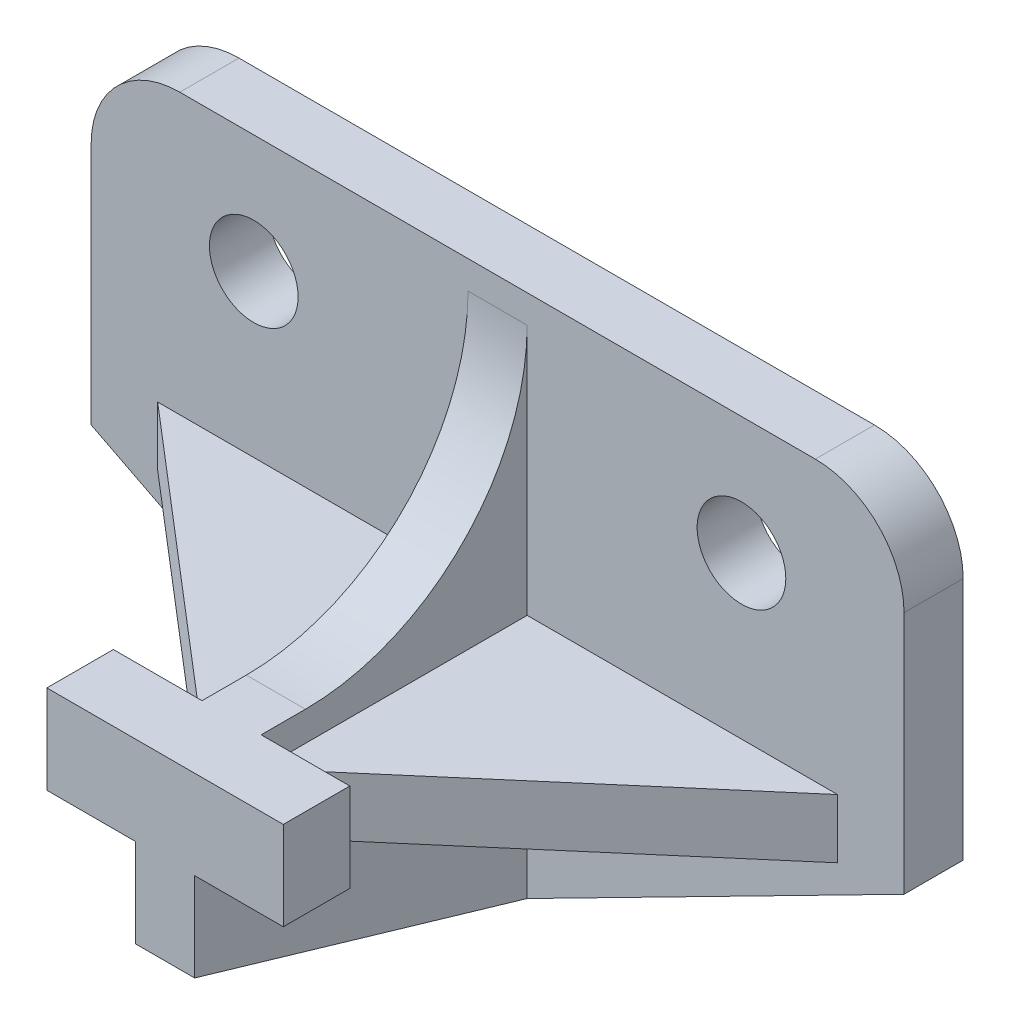
ISO-10303-21;
HEADER;
FILE_DESCRIPTION(('STEP AP214'),'2;1');
FILE_NAME('part.step','',(''),(''),'','','');
FILE_SCHEMA(('AUTOMOTIVE_DESIGN { 1 0 10303 214 1 1 1 1 }'));
ENDSEC;
DATA;
#1=APPLICATION_CONTEXT('core data for automotive mechanical design processes');
#2=APPLICATION_PROTOCOL_DEFINITION('international standard','automotive_design',2000,#1);
#3=PRODUCT_CONTEXT('',#1,'mechanical');
#4=PRODUCT('Part','Part','',(#3));
#5=PRODUCT_RELATED_PRODUCT_CATEGORY('part','',(#4));
#6=PRODUCT_DEFINITION_FORMATION('','',#4);
#7=PRODUCT_DEFINITION_CONTEXT('part definition',#1,'design');
#8=PRODUCT_DEFINITION('design','',#6,#7);
#9=PRODUCT_DEFINITION_SHAPE('','',#8);
#10=(LENGTH_UNIT() NAMED_UNIT(*) SI_UNIT(.MILLI.,.METRE.));
#11=(NAMED_UNIT(*) PLANE_ANGLE_UNIT() SI_UNIT($,.RADIAN.));
#12=(NAMED_UNIT(*) SI_UNIT($,.STERADIAN.) SOLID_ANGLE_UNIT());
#13=UNCERTAINTY_MEASURE_WITH_UNIT(LENGTH_MEASURE(1.E-05),#10,'distance_accuracy_value','');
#14=(GEOMETRIC_REPRESENTATION_CONTEXT(3) GLOBAL_UNCERTAINTY_ASSIGNED_CONTEXT((#13)) GLOBAL_UNIT_ASSIGNED_CONTEXT((#10,
#11,#12)) REPRESENTATION_CONTEXT('',''));
#15=CARTESIAN_POINT('',(0.,0.,0.));
#16=DIRECTION('',(0.,0.,1.));
#17=DIRECTION('',(1.,0.,0.));
#18=AXIS2_PLACEMENT_3D('',#15,#16,#17);
#19=CARTESIAN_POINT('',(0.,-15.3114963605045,0.));
#20=DIRECTION('',(0.,-1.,0.));
#21=DIRECTION('',(0.,0.,-1.));
#22=AXIS2_PLACEMENT_3D('',#19,#20,#21);
#23=PLANE('',#22);
#24=DIRECTION('',(0.,0.,1.));
#25=VECTOR('',#24,1.);
#26=CARTESIAN_POINT('',(-4.,-15.3114963605045,0.));
#27=LINE('',#26,#25);
#28=CARTESIAN_POINT('',(-4.,-15.3114963605045,0.));
#29=VERTEX_POINT('',#28);
#30=CARTESIAN_POINT('',(-4.,-15.3114963605045,36.));
#31=VERTEX_POINT('',#30);
#32=EDGE_CURVE('E255',#29,#31,#27,.T.);
#33=ORIENTED_EDGE('',*,*,#32,.F.);
#34=DIRECTION('',(-1.,0.,0.));
#35=VECTOR('',#34,1.);
#36=CARTESIAN_POINT('',(-46.,-15.3114963605045,0.));
#37=LINE('',#36,#35);
#38=CARTESIAN_POINT('',(-46.,-15.3114963605045,0.));
#39=VERTEX_POINT('',#38);
#40=EDGE_CURVE('E348',#29,#39,#37,.T.);
#41=ORIENTED_EDGE('',*,*,#40,.T.);
#42=DIRECTION('',(0.759256602365297,0.,0.650791373455968));
#43=VECTOR('',#42,1.);
#44=CARTESIAN_POINT('',(-46.,-15.3114963605045,0.));
#45=LINE('',#44,#43);
#46=EDGE_CURVE('E524',#39,#31,#45,.T.);
#47=ORIENTED_EDGE('',*,*,#46,.T.);
#48=EDGE_LOOP('',(#33,#41,#47));
#49=FACE_BOUND('',#48,.T.);
#50=ADVANCED_FACE('F57',(#49),#23,.F.);
#51=CARTESIAN_POINT('',(0.,0.,36.));
#52=DIRECTION('',(0.,0.,1.));
#53=DIRECTION('',(1.,0.,0.));
#54=AXIS2_PLACEMENT_3D('',#51,#52,#53);
#55=PLANE('',#54);
#56=DIRECTION('',(0.,1.,0.));
#57=VECTOR('',#56,1.);
#58=CARTESIAN_POINT('',(-4.,0.,36.));
#59=LINE('',#58,#57);
#60=CARTESIAN_POINT('',(-4.,-11.3114963605045,36.));
#61=VERTEX_POINT('',#60);
#62=EDGE_CURVE('E251',#31,#61,#59,.T.);
#63=ORIENTED_EDGE('',*,*,#62,.F.);
#64=DIRECTION('',(0.,-1.,0.));
#65=VECTOR('',#64,1.);
#66=CARTESIAN_POINT('',(-3.99999999999998,-15.3114963605045,36.));
#67=LINE('',#66,#65);
#68=CARTESIAN_POINT('',(-4.,-23.3114963605045,36.));
#69=VERTEX_POINT('',#68);
#70=EDGE_CURVE('E346',#31,#69,#67,.T.);
#71=ORIENTED_EDGE('',*,*,#70,.T.);
#72=DIRECTION('',(1.,0.,0.));
#73=VECTOR('',#72,1.);
#74=CARTESIAN_POINT('',(-16.,-23.3114963605045,36.));
#75=LINE('',#74,#73);
#76=CARTESIAN_POINT('',(-16.,-23.3114963605045,36.));
#77=VERTEX_POINT('',#76);
#78=EDGE_CURVE('E302',#77,#69,#75,.T.);
#79=ORIENTED_EDGE('',*,*,#78,.F.);
#80=DIRECTION('',(0.,-1.,0.));
#81=VECTOR('',#80,1.);
#82=CARTESIAN_POINT('',(-16.,-11.3114963605045,36.));
#83=LINE('',#82,#81);
#84=CARTESIAN_POINT('',(-16.,-11.3114963605045,36.));
#85=VERTEX_POINT('',#84);
#86=EDGE_CURVE('E446',#85,#77,#83,.T.);
#87=ORIENTED_EDGE('',*,*,#86,.F.);
#88=DIRECTION('',(-1.,0.,0.));
#89=VECTOR('',#88,1.);
#90=CARTESIAN_POINT('',(-16.,-11.3114963605045,36.));
#91=LINE('',#90,#89);
#92=EDGE_CURVE('E451',#61,#85,#91,.T.);
#93=ORIENTED_EDGE('',*,*,#92,.F.);
#94=EDGE_LOOP('',(#63,#71,#79,#87,#93));
#95=FACE_BOUND('',#94,.T.);
#96=ADVANCED_FACE('F485',(#95),#55,.F.);
#97=CARTESIAN_POINT('',(0.,0.,0.));
#98=DIRECTION('',(0.,0.,-1.));
#99=DIRECTION('',(-1.,0.,0.));
#100=AXIS2_PLACEMENT_3D('',#97,#98,#99);
#101=PLANE('',#100);
#102=CARTESIAN_POINT('',(-33.,6.5,0.));
#103=DIRECTION('',(0.,0.,1.));
#104=DIRECTION('',(1.,0.,0.));
#105=AXIS2_PLACEMENT_3D('',#102,#103,#104);
#106=CIRCLE('',#105,6.);
#107=CARTESIAN_POINT('',(-27.,6.5,0.));
#108=VERTEX_POINT('',#107);
#109=EDGE_CURVE('E733',#108,#108,#106,.T.);
#110=ORIENTED_EDGE('',*,*,#109,.F.);
#111=EDGE_LOOP('',(#110));
#112=FACE_BOUND('',#111,.T.);
#113=CARTESIAN_POINT('',(33.,6.50000000000001,0.));
#114=DIRECTION('',(0.,0.,1.));
#115=DIRECTION('',(1.,0.,0.));
#116=AXIS2_PLACEMENT_3D('',#113,#114,#115);
#117=CIRCLE('',#116,6.00000000000001);
#118=CARTESIAN_POINT('',(39.,6.50000000000001,0.));
#119=VERTEX_POINT('',#118);
#120=EDGE_CURVE('E738',#119,#119,#117,.T.);
#121=ORIENTED_EDGE('',*,*,#120,.F.);
#122=EDGE_LOOP('',(#121));
#123=FACE_BOUND('',#122,.T.);
#124=DIRECTION('',(0.,1.,0.));
#125=VECTOR('',#124,1.);
#126=CARTESIAN_POINT('',(55.,22.5,0.));
#127=LINE('',#126,#125);
#128=CARTESIAN_POINT('',(55.,-22.5,0.));
#129=VERTEX_POINT('',#128);
#130=CARTESIAN_POINT('',(55.,10.5,0.));
#131=VERTEX_POINT('',#130);
#132=EDGE_CURVE('E640',#129,#131,#127,.T.);
#133=ORIENTED_EDGE('',*,*,#132,.T.);
#134=CARTESIAN_POINT('',(43.,10.5,0.));
#135=DIRECTION('',(0.,0.,-1.));
#136=DIRECTION('',(-1.,0.,0.));
#137=AXIS2_PLACEMENT_3D('',#134,#135,#136);
#138=CIRCLE('',#137,12.);
#139=CARTESIAN_POINT('',(43.,22.5,0.));
#140=VERTEX_POINT('',#139);
#141=EDGE_CURVE('E1025',#131,#140,#138,.F.);
#142=ORIENTED_EDGE('',*,*,#141,.T.);
#143=DIRECTION('',(-1.,0.,0.));
#144=VECTOR('',#143,1.);
#145=CARTESIAN_POINT('',(-55.,22.5,0.));
#146=LINE('',#145,#144);
#147=CARTESIAN_POINT('',(-43.,22.5,0.));
#148=VERTEX_POINT('',#147);
#149=EDGE_CURVE('E989',#140,#148,#146,.T.);
#150=ORIENTED_EDGE('',*,*,#149,.T.);
#151=CARTESIAN_POINT('',(-43.,10.5,0.));
#152=DIRECTION('',(0.,0.,-1.));
#153=DIRECTION('',(-1.,0.,0.));
#154=AXIS2_PLACEMENT_3D('',#151,#152,#153);
#155=CIRCLE('',#154,12.);
#156=CARTESIAN_POINT('',(-55.,10.5,0.));
#157=VERTEX_POINT('',#156);
#158=EDGE_CURVE('E1022',#148,#157,#155,.F.);
#159=ORIENTED_EDGE('',*,*,#158,.T.);
#160=DIRECTION('',(0.,-1.,0.));
#161=VECTOR('',#160,1.);
#162=CARTESIAN_POINT('',(-55.,22.5,0.));
#163=LINE('',#162,#161);
#164=CARTESIAN_POINT('',(-55.,-22.5,0.));
#165=VERTEX_POINT('',#164);
#166=EDGE_CURVE('E628',#157,#165,#163,.T.);
#167=ORIENTED_EDGE('',*,*,#166,.T.);
#168=DIRECTION('',(0.89090614690198,-0.454187447440225,0.));
#169=VECTOR('',#168,1.);
#170=CARTESIAN_POINT('',(-3.99999999999999,-48.5,0.));
#171=LINE('',#170,#169);
#172=CARTESIAN_POINT('',(-4.,-48.5,0.));
#173=VERTEX_POINT('',#172);
#174=EDGE_CURVE('E623',#165,#173,#171,.T.);
#175=ORIENTED_EDGE('',*,*,#174,.T.);
#176=DIRECTION('',(0.,-1.,0.));
#177=VECTOR('',#176,1.);
#178=CARTESIAN_POINT('',(-4.,-23.3114963605045,0.));
#179=LINE('',#178,#177);
#180=CARTESIAN_POINT('',(-4.,-23.3114963605045,0.));
#181=VERTEX_POINT('',#180);
#182=EDGE_CURVE('E294',#181,#173,#179,.T.);
#183=ORIENTED_EDGE('',*,*,#182,.F.);
#184=DIRECTION('',(1.,0.,0.));
#185=VECTOR('',#184,1.);
#186=CARTESIAN_POINT('',(-46.,-23.3114963605045,0.));
#187=LINE('',#186,#185);
#188=CARTESIAN_POINT('',(-46.,-23.3114963605045,0.));
#189=VERTEX_POINT('',#188);
#190=EDGE_CURVE('E610',#189,#181,#187,.T.);
#191=ORIENTED_EDGE('',*,*,#190,.F.);
#192=DIRECTION('',(0.,-1.,0.));
#193=VECTOR('',#192,1.);
#194=CARTESIAN_POINT('',(-46.,-15.3114963605045,0.));
#195=LINE('',#194,#193);
#196=EDGE_CURVE('E534',#39,#189,#195,.T.);
#197=ORIENTED_EDGE('',*,*,#196,.F.);
#198=ORIENTED_EDGE('',*,*,#40,.F.);
#199=DIRECTION('',(0.,-1.,0.));
#200=VECTOR('',#199,1.);
#201=CARTESIAN_POINT('',(-4.,0.,0.));
#202=LINE('',#201,#200);
#203=CARTESIAN_POINT('',(-4.,18.6885036394955,0.));
#204=VERTEX_POINT('',#203);
#205=EDGE_CURVE('E260',#204,#29,#202,.T.);
#206=ORIENTED_EDGE('',*,*,#205,.F.);
#207=DIRECTION('',(1.,0.,0.));
#208=VECTOR('',#207,1.);
#209=CARTESIAN_POINT('',(0.,18.6885036394955,0.));
#210=LINE('',#209,#208);
#211=CARTESIAN_POINT('',(4.,18.6885036394955,0.));
#212=VERTEX_POINT('',#211);
#213=EDGE_CURVE('E235',#204,#212,#210,.T.);
#214=ORIENTED_EDGE('',*,*,#213,.T.);
#215=DIRECTION('',(0.,-1.,0.));
#216=VECTOR('',#215,1.);
#217=CARTESIAN_POINT('',(4.,0.,0.));
#218=LINE('',#217,#216);
#219=CARTESIAN_POINT('',(4.,-15.3114963605045,0.));
#220=VERTEX_POINT('',#219);
#221=EDGE_CURVE('E239',#212,#220,#218,.T.);
#222=ORIENTED_EDGE('',*,*,#221,.T.);
#223=CARTESIAN_POINT('',(46.,-15.3114963605045,0.));
#224=VERTEX_POINT('',#223);
#225=EDGE_CURVE('E529',#224,#220,#37,.T.);
#226=ORIENTED_EDGE('',*,*,#225,.F.);
#227=DIRECTION('',(0.,1.,0.));
#228=VECTOR('',#227,1.);
#229=CARTESIAN_POINT('',(46.,-15.3114963605045,0.));
#230=LINE('',#229,#228);
#231=CARTESIAN_POINT('',(46.,-23.3114963605045,0.));
#232=VERTEX_POINT('',#231);
#233=EDGE_CURVE('E322',#232,#224,#230,.T.);
#234=ORIENTED_EDGE('',*,*,#233,.F.);
#235=CARTESIAN_POINT('',(4.,-23.3114963605045,0.));
#236=VERTEX_POINT('',#235);
#237=EDGE_CURVE('E327',#236,#232,#187,.T.);
#238=ORIENTED_EDGE('',*,*,#237,.F.);
#239=DIRECTION('',(0.,1.,0.));
#240=VECTOR('',#239,1.);
#241=CARTESIAN_POINT('',(4.,-23.3114963605045,0.));
#242=LINE('',#241,#240);
#243=CARTESIAN_POINT('',(4.00000000000001,-48.5,0.));
#244=VERTEX_POINT('',#243);
#245=EDGE_CURVE('E278',#244,#236,#242,.T.);
#246=ORIENTED_EDGE('',*,*,#245,.F.);
#247=DIRECTION('',(0.89090614690198,0.454187447440225,0.));
#248=VECTOR('',#247,1.);
#249=CARTESIAN_POINT('',(4.00000000000001,-48.5,0.));
#250=LINE('',#249,#248);
#251=EDGE_CURVE('E354',#244,#129,#250,.T.);
#252=ORIENTED_EDGE('',*,*,#251,.T.);
#253=EDGE_LOOP('',(#133,#142,#150,#159,#167,#175,#183,#191,#197,#198,#206,#214,#222,#226,#234,
#238,#246,#252));
#254=FACE_BOUND('',#253,.T.);
#255=ADVANCED_FACE('F597',(#112,#123,#254),#101,.F.);
#256=CARTESIAN_POINT('',(0.,-23.3114963605045,0.));
#257=DIRECTION('',(0.,1.,0.));
#258=DIRECTION('',(0.,0.,1.));
#259=AXIS2_PLACEMENT_3D('',#256,#257,#258);
#260=PLANE('',#259);
#261=DIRECTION('',(0.,0.,1.));
#262=VECTOR('',#261,1.);
#263=CARTESIAN_POINT('',(4.,-23.3114963605045,0.));
#264=LINE('',#263,#262);
#265=CARTESIAN_POINT('',(4.,-23.3114963605045,36.));
#266=VERTEX_POINT('',#265);
#267=EDGE_CURVE('E279',#236,#266,#264,.T.);
#268=ORIENTED_EDGE('',*,*,#267,.F.);
#269=ORIENTED_EDGE('',*,*,#237,.T.);
#270=DIRECTION('',(-0.759256602365296,0.,0.650791373455969));
#271=VECTOR('',#270,1.);
#272=CARTESIAN_POINT('',(46.,-23.3114963605045,0.));
#273=LINE('',#272,#271);
#274=EDGE_CURVE('E347',#232,#266,#273,.T.);
#275=ORIENTED_EDGE('',*,*,#274,.T.);
#276=EDGE_LOOP('',(#268,#269,#275));
#277=FACE_BOUND('',#276,.T.);
#278=ADVANCED_FACE('F552',(#277),#260,.F.);
#279=CARTESIAN_POINT('',(4.,-23.3114963605045,45.));
#280=VERTEX_POINT('',#279);
#281=EDGE_CURVE('E283',#266,#280,#264,.T.);
#282=ORIENTED_EDGE('',*,*,#281,.F.);
#283=CARTESIAN_POINT('',(16.,-23.3114963605045,36.));
#284=VERTEX_POINT('',#283);
#285=EDGE_CURVE('E443',#266,#284,#75,.T.);
#286=ORIENTED_EDGE('',*,*,#285,.T.);
#287=DIRECTION('',(0.,0.,-1.));
#288=VECTOR('',#287,1.);
#289=CARTESIAN_POINT('',(16.,-23.3114963605045,45.));
#290=LINE('',#289,#288);
#291=CARTESIAN_POINT('',(16.,-23.3114963605045,45.));
#292=VERTEX_POINT('',#291);
#293=EDGE_CURVE('E321',#292,#284,#290,.T.);
#294=ORIENTED_EDGE('',*,*,#293,.F.);
#295=DIRECTION('',(1.,0.,0.));
#296=VECTOR('',#295,1.);
#297=CARTESIAN_POINT('',(-16.,-23.3114963605045,45.));
#298=LINE('',#297,#296);
#299=EDGE_CURVE('E308',#280,#292,#298,.T.);
#300=ORIENTED_EDGE('',*,*,#299,.F.);
#301=EDGE_LOOP('',(#282,#286,#294,#300));
#302=FACE_BOUND('',#301,.T.);
#303=ADVANCED_FACE('F436',(#302),#260,.F.);
#304=DIRECTION('',(0.,0.,1.));
#305=VECTOR('',#304,1.);
#306=CARTESIAN_POINT('',(-4.,-23.3114963605045,0.));
#307=LINE('',#306,#305);
#308=CARTESIAN_POINT('',(-4.,-23.3114963605045,45.));
#309=VERTEX_POINT('',#308);
#310=EDGE_CURVE('E295',#69,#309,#307,.T.);
#311=ORIENTED_EDGE('',*,*,#310,.T.);
#312=CARTESIAN_POINT('',(-16.,-23.3114963605045,45.));
#313=VERTEX_POINT('',#312);
#314=EDGE_CURVE('E317',#313,#309,#298,.T.);
#315=ORIENTED_EDGE('',*,*,#314,.F.);
#316=DIRECTION('',(0.,0.,-1.));
#317=VECTOR('',#316,1.);
#318=CARTESIAN_POINT('',(-16.,-23.3114963605045,45.));
#319=LINE('',#318,#317);
#320=EDGE_CURVE('E467',#313,#77,#319,.T.);
#321=ORIENTED_EDGE('',*,*,#320,.T.);
#322=ORIENTED_EDGE('',*,*,#78,.T.);
#323=EDGE_LOOP('',(#311,#315,#321,#322));
#324=FACE_BOUND('',#323,.T.);
#325=ADVANCED_FACE('F479',(#324),#260,.F.);
#326=EDGE_CURVE('E286',#181,#69,#307,.T.);
#327=ORIENTED_EDGE('',*,*,#326,.T.);
#328=DIRECTION('',(0.759256602365297,0.,0.650791373455968));
#329=VECTOR('',#328,1.);
#330=CARTESIAN_POINT('',(-46.,-23.3114963605045,0.));
#331=LINE('',#330,#329);
#332=EDGE_CURVE('E523',#189,#69,#331,.T.);
#333=ORIENTED_EDGE('',*,*,#332,.F.);
#334=ORIENTED_EDGE('',*,*,#190,.T.);
#335=EDGE_LOOP('',(#327,#333,#334));
#336=FACE_BOUND('',#335,.T.);
#337=ADVANCED_FACE('F679',(#336),#260,.F.);
#338=CARTESIAN_POINT('',(4.00000000000001,-48.5,-8.));
#339=DIRECTION('',(0.454187447440225,-0.89090614690198,0.));
#340=DIRECTION('',(0.89090614690198,0.454187447440225,0.));
#341=AXIS2_PLACEMENT_3D('',#338,#339,#340);
#342=PLANE('',#341);
#343=ORIENTED_EDGE('',*,*,#251,.F.);
#344=DIRECTION('',(0.,0.,1.));
#345=VECTOR('',#344,1.);
#346=CARTESIAN_POINT('',(4.00000000000001,-48.5,-8.));
#347=LINE('',#346,#345);
#348=CARTESIAN_POINT('',(4.00000000000001,-48.5,-8.));
#349=VERTEX_POINT('',#348);
#350=EDGE_CURVE('E619',#349,#244,#347,.T.);
#351=ORIENTED_EDGE('',*,*,#350,.F.);
#352=DIRECTION('',(0.89090614690198,0.454187447440225,0.));
#353=VECTOR('',#352,1.);
#354=CARTESIAN_POINT('',(4.00000000000001,-48.5,-8.));
#355=LINE('',#354,#353);
#356=CARTESIAN_POINT('',(55.,-22.5,-8.));
#357=VERTEX_POINT('',#356);
#358=EDGE_CURVE('E985',#349,#357,#355,.T.);
#359=ORIENTED_EDGE('',*,*,#358,.T.);
#360=DIRECTION('',(0.,0.,1.));
#361=VECTOR('',#360,1.);
#362=CARTESIAN_POINT('',(55.,-22.5,-8.));
#363=LINE('',#362,#361);
#364=EDGE_CURVE('E983',#357,#129,#363,.T.);
#365=ORIENTED_EDGE('',*,*,#364,.T.);
#366=EDGE_LOOP('',(#343,#351,#359,#365));
#367=FACE_BOUND('',#366,.T.);
#368=ADVANCED_FACE('F661',(#367),#342,.T.);
#369=CARTESIAN_POINT('',(-3.99999999999999,-48.5,-8.));
#370=DIRECTION('',(0.,-1.,0.));
#371=DIRECTION('',(0.,0.,-1.));
#372=AXIS2_PLACEMENT_3D('',#369,#370,#371);
#373=PLANE('',#372);
#374=CARTESIAN_POINT('',(-4.,-48.5,0.));
#375=DIRECTION('',(1.,0.,0.));
#376=VECTOR('',#375,1.);
#377=LINE('',#374,#376);
#378=EDGE_CURVE('E627',#173,#244,#377,.T.);
#379=ORIENTED_EDGE('',*,*,#378,.F.);
#380=DIRECTION('',(0.,0.,1.));
#381=VECTOR('',#380,1.);
#382=CARTESIAN_POINT('',(-3.99999999999999,-48.5,-8.));
#383=LINE('',#382,#381);
#384=CARTESIAN_POINT('',(-3.99999999999999,-48.5,-8.));
#385=VERTEX_POINT('',#384);
#386=EDGE_CURVE('E615',#385,#173,#383,.T.);
#387=ORIENTED_EDGE('',*,*,#386,.F.);
#388=DIRECTION('',(1.,0.,0.));
#389=VECTOR('',#388,1.);
#390=CARTESIAN_POINT('',(-3.99999999999999,-48.5,-8.));
#391=LINE('',#390,#389);
#392=EDGE_CURVE('E980',#385,#349,#391,.T.);
#393=ORIENTED_EDGE('',*,*,#392,.T.);
#394=ORIENTED_EDGE('',*,*,#350,.T.);
#395=EDGE_LOOP('',(#379,#387,#393,#394));
#396=FACE_BOUND('',#395,.T.);
#397=ADVANCED_FACE('F651',(#396),#373,.T.);
#398=CARTESIAN_POINT('',(-3.99999999999999,-48.5,-8.));
#399=DIRECTION('',(-0.454187447440225,-0.89090614690198,0.));
#400=DIRECTION('',(0.89090614690198,-0.454187447440225,0.));
#401=AXIS2_PLACEMENT_3D('',#398,#399,#400);
#402=PLANE('',#401);
#403=ORIENTED_EDGE('',*,*,#174,.F.);
#404=DIRECTION('',(0.,0.,1.));
#405=VECTOR('',#404,1.);
#406=CARTESIAN_POINT('',(-55.,-22.5,-8.));
#407=LINE('',#406,#405);
#408=CARTESIAN_POINT('',(-55.,-22.5,-8.));
#409=VERTEX_POINT('',#408);
#410=EDGE_CURVE('E620',#409,#165,#407,.T.);
#411=ORIENTED_EDGE('',*,*,#410,.F.);
#412=DIRECTION('',(0.89090614690198,-0.454187447440225,0.));
#413=VECTOR('',#412,1.);
#414=CARTESIAN_POINT('',(-3.99999999999999,-48.5,-8.));
#415=LINE('',#414,#413);
#416=EDGE_CURVE('E1012',#409,#385,#415,.T.);
#417=ORIENTED_EDGE('',*,*,#416,.T.);
#418=ORIENTED_EDGE('',*,*,#386,.T.);
#419=EDGE_LOOP('',(#403,#411,#417,#418));
#420=FACE_BOUND('',#419,.T.);
#421=ADVANCED_FACE('F660',(#420),#402,.T.);
#422=CARTESIAN_POINT('',(-55.,22.5,-8.));
#423=DIRECTION('',(-1.,0.,0.));
#424=DIRECTION('',(0.,0.,1.));
#425=AXIS2_PLACEMENT_3D('',#422,#423,#424);
#426=PLANE('',#425);
#427=ORIENTED_EDGE('',*,*,#166,.F.);
#428=DIRECTION('',(0.,0.,1.));
#429=VECTOR('',#428,1.);
#430=CARTESIAN_POINT('',(-55.,10.5,-8.));
#431=LINE('',#430,#429);
#432=CARTESIAN_POINT('',(-55.,10.5,-8.));
#433=VERTEX_POINT('',#432);
#434=EDGE_CURVE('E12',#157,#433,#431,.F.);
#435=ORIENTED_EDGE('',*,*,#434,.T.);
#436=DIRECTION('',(0.,-1.,0.));
#437=VECTOR('',#436,1.);
#438=CARTESIAN_POINT('',(-55.,22.5,-8.));
#439=LINE('',#438,#437);
#440=EDGE_CURVE('E720',#433,#409,#439,.T.);
#441=ORIENTED_EDGE('',*,*,#440,.T.);
#442=ORIENTED_EDGE('',*,*,#410,.T.);
#443=EDGE_LOOP('',(#427,#435,#441,#442));
#444=FACE_BOUND('',#443,.T.);
#445=ADVANCED_FACE('F665',(#444),#426,.T.);
#446=CARTESIAN_POINT('',(-55.,22.5,-8.));
#447=DIRECTION('',(0.,1.,0.));
#448=DIRECTION('',(0.,0.,1.));
#449=AXIS2_PLACEMENT_3D('',#446,#447,#448);
#450=PLANE('',#449);
#451=ORIENTED_EDGE('',*,*,#149,.F.);
#452=DIRECTION('',(0.,0.,1.));
#453=VECTOR('',#452,1.);
#454=CARTESIAN_POINT('',(43.,22.5,-8.));
#455=LINE('',#454,#453);
#456=CARTESIAN_POINT('',(43.,22.5,-8.));
#457=VERTEX_POINT('',#456);
#458=EDGE_CURVE('E725',#140,#457,#455,.F.);
#459=ORIENTED_EDGE('',*,*,#458,.T.);
#460=DIRECTION('',(-1.,0.,0.));
#461=VECTOR('',#460,1.);
#462=CARTESIAN_POINT('',(-55.,22.5,-8.));
#463=LINE('',#462,#461);
#464=CARTESIAN_POINT('',(-43.,22.5,-8.));
#465=VERTEX_POINT('',#464);
#466=EDGE_CURVE('E714',#457,#465,#463,.T.);
#467=ORIENTED_EDGE('',*,*,#466,.T.);
#468=DIRECTION('',(0.,0.,1.));
#469=VECTOR('',#468,1.);
#470=CARTESIAN_POINT('',(-43.,22.5,-8.));
#471=LINE('',#470,#469);
#472=EDGE_CURVE('E1021',#465,#148,#471,.T.);
#473=ORIENTED_EDGE('',*,*,#472,.T.);
#474=EDGE_LOOP('',(#451,#459,#467,#473));
#475=FACE_BOUND('',#474,.T.);
#476=ADVANCED_FACE('F669',(#475),#450,.T.);
#477=CARTESIAN_POINT('',(55.,22.5,-8.));
#478=DIRECTION('',(1.,0.,0.));
#479=DIRECTION('',(0.,0.,-1.));
#480=AXIS2_PLACEMENT_3D('',#477,#478,#479);
#481=PLANE('',#480);
#482=DIRECTION('',(0.,1.,0.));
#483=VECTOR('',#482,1.);
#484=CARTESIAN_POINT('',(55.,22.5,-8.));
#485=LINE('',#484,#483);
#486=CARTESIAN_POINT('',(55.,10.5,-8.));
#487=VERTEX_POINT('',#486);
#488=EDGE_CURVE('E721',#357,#487,#485,.T.);
#489=ORIENTED_EDGE('',*,*,#488,.T.);
#490=DIRECTION('',(0.,0.,1.));
#491=VECTOR('',#490,1.);
#492=CARTESIAN_POINT('',(55.,10.5,-8.));
#493=LINE('',#492,#491);
#494=EDGE_CURVE('E634',#487,#131,#493,.T.);
#495=ORIENTED_EDGE('',*,*,#494,.T.);
#496=ORIENTED_EDGE('',*,*,#132,.F.);
#497=ORIENTED_EDGE('',*,*,#364,.F.);
#498=EDGE_LOOP('',(#489,#495,#496,#497));
#499=FACE_BOUND('',#498,.T.);
#500=ADVANCED_FACE('F672',(#499),#481,.T.);
#501=CARTESIAN_POINT('',(0.,0.,-8.));
#502=DIRECTION('',(0.,0.,-1.));
#503=DIRECTION('',(-1.,0.,0.));
#504=AXIS2_PLACEMENT_3D('',#501,#502,#503);
#505=PLANE('',#504);
#506=CARTESIAN_POINT('',(-33.,6.5,-8.));
#507=DIRECTION('',(0.,0.,-1.));
#508=DIRECTION('',(-1.,0.,0.));
#509=AXIS2_PLACEMENT_3D('',#506,#507,#508);
#510=CIRCLE('',#509,6.);
#511=CARTESIAN_POINT('',(-39.,6.5,-8.));
#512=VERTEX_POINT('',#511);
#513=EDGE_CURVE('E61',#512,#512,#510,.T.);
#514=ORIENTED_EDGE('',*,*,#513,.F.);
#515=EDGE_LOOP('',(#514));
#516=FACE_BOUND('',#515,.T.);
#517=CARTESIAN_POINT('',(33.,6.50000000000001,-8.));
#518=DIRECTION('',(0.,0.,-1.));
#519=DIRECTION('',(-1.,0.,0.));
#520=AXIS2_PLACEMENT_3D('',#517,#518,#519);
#521=CIRCLE('',#520,6.00000000000001);
#522=CARTESIAN_POINT('',(27.,6.50000000000001,-8.));
#523=VERTEX_POINT('',#522);
#524=EDGE_CURVE('E713',#523,#523,#521,.T.);
#525=ORIENTED_EDGE('',*,*,#524,.F.);
#526=EDGE_LOOP('',(#525));
#527=FACE_BOUND('',#526,.T.);
#528=ORIENTED_EDGE('',*,*,#466,.F.);
#529=CARTESIAN_POINT('',(43.,10.5,-8.));
#530=DIRECTION('',(0.,0.,-1.));
#531=DIRECTION('',(-1.,0.,0.));
#532=AXIS2_PLACEMENT_3D('',#529,#530,#531);
#533=CIRCLE('',#532,12.);
#534=EDGE_CURVE('E67',#457,#487,#533,.T.);
#535=ORIENTED_EDGE('',*,*,#534,.T.);
#536=ORIENTED_EDGE('',*,*,#488,.F.);
#537=ORIENTED_EDGE('',*,*,#358,.F.);
#538=ORIENTED_EDGE('',*,*,#392,.F.);
#539=ORIENTED_EDGE('',*,*,#416,.F.);
#540=ORIENTED_EDGE('',*,*,#440,.F.);
#541=CARTESIAN_POINT('',(-43.,10.5,-8.));
#542=DIRECTION('',(0.,0.,-1.));
#543=DIRECTION('',(-1.,0.,0.));
#544=AXIS2_PLACEMENT_3D('',#541,#542,#543);
#545=CIRCLE('',#544,12.);
#546=EDGE_CURVE('E80',#433,#465,#545,.T.);
#547=ORIENTED_EDGE('',*,*,#546,.T.);
#548=EDGE_LOOP('',(#528,#535,#536,#537,#538,#539,#540,#547));
#549=FACE_BOUND('',#548,.T.);
#550=ADVANCED_FACE('F676',(#516,#527,#549),#505,.T.);
#551=ORIENTED_EDGE('',*,*,#225,.T.);
#552=DIRECTION('',(0.,0.,1.));
#553=VECTOR('',#552,1.);
#554=CARTESIAN_POINT('',(4.,-15.3114963605045,0.));
#555=LINE('',#554,#553);
#556=CARTESIAN_POINT('',(4.,-15.3114963605045,36.));
#557=VERTEX_POINT('',#556);
#558=EDGE_CURVE('E268',#220,#557,#555,.T.);
#559=ORIENTED_EDGE('',*,*,#558,.T.);
#560=DIRECTION('',(-0.759256602365296,0.,0.650791373455969));
#561=VECTOR('',#560,1.);
#562=CARTESIAN_POINT('',(46.,-15.3114963605045,0.));
#563=LINE('',#562,#561);
#564=EDGE_CURVE('E514',#224,#557,#563,.T.);
#565=ORIENTED_EDGE('',*,*,#564,.F.);
#566=EDGE_LOOP('',(#551,#559,#565));
#567=FACE_BOUND('',#566,.T.);
#568=ADVANCED_FACE('F694',(#567),#23,.F.);
#569=CARTESIAN_POINT('',(19.4823529411765,0.,22.7294117647059));
#570=DIRECTION('',(-0.650791373455969,0.,-0.759256602365296));
#571=DIRECTION('',(-0.759256602365296,0.,0.650791373455969));
#572=AXIS2_PLACEMENT_3D('',#569,#570,#571);
#573=PLANE('',#572);
#574=ORIENTED_EDGE('',*,*,#564,.T.);
#575=DIRECTION('',(0.,1.,0.));
#576=VECTOR('',#575,1.);
#577=CARTESIAN_POINT('',(4.00000000000002,-15.3114963605045,36.));
#578=LINE('',#577,#576);
#579=EDGE_CURVE('E341',#266,#557,#578,.T.);
#580=ORIENTED_EDGE('',*,*,#579,.F.);
#581=ORIENTED_EDGE('',*,*,#274,.F.);
#582=ORIENTED_EDGE('',*,*,#233,.T.);
#583=EDGE_LOOP('',(#574,#580,#581,#582));
#584=FACE_BOUND('',#583,.T.);
#585=ADVANCED_FACE('F549',(#584),#573,.F.);
#586=CARTESIAN_POINT('',(-19.4823529411765,0.,22.7294117647059));
#587=DIRECTION('',(0.650791373455968,0.,-0.759256602365297));
#588=DIRECTION('',(-0.759256602365297,0.,-0.650791373455968));
#589=AXIS2_PLACEMENT_3D('',#586,#587,#588);
#590=PLANE('',#589);
#591=ORIENTED_EDGE('',*,*,#332,.T.);
#592=ORIENTED_EDGE('',*,*,#70,.F.);
#593=ORIENTED_EDGE('',*,*,#46,.F.);
#594=ORIENTED_EDGE('',*,*,#196,.T.);
#595=EDGE_LOOP('',(#591,#592,#593,#594));
#596=FACE_BOUND('',#595,.T.);
#597=ADVANCED_FACE('F506',(#596),#590,.F.);
#598=ORIENTED_EDGE('',*,*,#579,.T.);
#599=DIRECTION('',(0.,1.,0.));
#600=VECTOR('',#599,1.);
#601=CARTESIAN_POINT('',(4.,0.,36.));
#602=LINE('',#601,#600);
#603=CARTESIAN_POINT('',(4.,-11.3114963605045,36.));
#604=VERTEX_POINT('',#603);
#605=EDGE_CURVE('E265',#557,#604,#602,.T.);
#606=ORIENTED_EDGE('',*,*,#605,.T.);
#607=CARTESIAN_POINT('',(16.,-11.3114963605045,36.));
#608=VERTEX_POINT('',#607);
#609=EDGE_CURVE('E221',#608,#604,#91,.T.);
#610=ORIENTED_EDGE('',*,*,#609,.F.);
#611=DIRECTION('',(0.,1.,0.));
#612=VECTOR('',#611,1.);
#613=CARTESIAN_POINT('',(16.,-11.3114963605045,36.));
#614=LINE('',#613,#612);
#615=EDGE_CURVE('E311',#284,#608,#614,.T.);
#616=ORIENTED_EDGE('',*,*,#615,.F.);
#617=ORIENTED_EDGE('',*,*,#285,.F.);
#618=EDGE_LOOP('',(#598,#606,#610,#616,#617));
#619=FACE_BOUND('',#618,.T.);
#620=ADVANCED_FACE('F460',(#619),#55,.F.);
#621=CARTESIAN_POINT('',(16.,-11.3114963605045,45.));
#622=DIRECTION('',(-1.,0.,0.));
#623=DIRECTION('',(0.,-1.,0.));
#624=AXIS2_PLACEMENT_3D('',#621,#622,#623);
#625=PLANE('',#624);
#626=ORIENTED_EDGE('',*,*,#615,.T.);
#627=DIRECTION('',(0.,0.,-1.));
#628=VECTOR('',#627,1.);
#629=CARTESIAN_POINT('',(16.,-11.3114963605045,45.));
#630=LINE('',#629,#628);
#631=CARTESIAN_POINT('',(16.,-11.3114963605045,45.));
#632=VERTEX_POINT('',#631);
#633=EDGE_CURVE('E328',#632,#608,#630,.T.);
#634=ORIENTED_EDGE('',*,*,#633,.F.);
#635=DIRECTION('',(0.,1.,0.));
#636=VECTOR('',#635,1.);
#637=CARTESIAN_POINT('',(16.,-11.3114963605045,45.));
#638=LINE('',#637,#636);
#639=EDGE_CURVE('E297',#292,#632,#638,.T.);
#640=ORIENTED_EDGE('',*,*,#639,.F.);
#641=ORIENTED_EDGE('',*,*,#293,.T.);
#642=EDGE_LOOP('',(#626,#634,#640,#641));
#643=FACE_BOUND('',#642,.T.);
#644=ADVANCED_FACE('F457',(#643),#625,.F.);
#645=CARTESIAN_POINT('',(-16.,-11.3114963605045,45.));
#646=DIRECTION('',(0.,-1.,0.));
#647=DIRECTION('',(0.,0.,-1.));
#648=AXIS2_PLACEMENT_3D('',#645,#646,#647);
#649=PLANE('',#648);
#650=ORIENTED_EDGE('',*,*,#609,.T.);
#651=DIRECTION('',(0.,0.,-1.));
#652=VECTOR('',#651,1.);
#653=CARTESIAN_POINT('',(4.,-11.3114963605045,18.5000375));
#654=LINE('',#653,#652);
#655=CARTESIAN_POINT('',(4.,-11.3114963605045,30.));
#656=VERTEX_POINT('',#655);
#657=EDGE_CURVE('E215',#604,#656,#654,.T.);
#658=ORIENTED_EDGE('',*,*,#657,.T.);
#659=DIRECTION('',(1.,0.,0.));
#660=VECTOR('',#659,1.);
#661=CARTESIAN_POINT('',(0.,-11.3114963605045,30.));
#662=LINE('',#661,#660);
#663=CARTESIAN_POINT('',(-4.,-11.3114963605045,30.));
#664=VERTEX_POINT('',#663);
#665=EDGE_CURVE('E218',#664,#656,#662,.T.);
#666=ORIENTED_EDGE('',*,*,#665,.F.);
#667=DIRECTION('',(0.,0.,-1.));
#668=VECTOR('',#667,1.);
#669=CARTESIAN_POINT('',(-4.,-11.3114963605045,18.5000375));
#670=LINE('',#669,#668);
#671=EDGE_CURVE('E241',#61,#664,#670,.T.);
#672=ORIENTED_EDGE('',*,*,#671,.F.);
#673=ORIENTED_EDGE('',*,*,#92,.T.);
#674=DIRECTION('',(0.,0.,-1.));
#675=VECTOR('',#674,1.);
#676=CARTESIAN_POINT('',(-16.,-11.3114963605045,45.));
#677=LINE('',#676,#675);
#678=CARTESIAN_POINT('',(-16.,-11.3114963605045,45.));
#679=VERTEX_POINT('',#678);
#680=EDGE_CURVE('E463',#679,#85,#677,.T.);
#681=ORIENTED_EDGE('',*,*,#680,.F.);
#682=DIRECTION('',(-1.,0.,0.));
#683=VECTOR('',#682,1.);
#684=CARTESIAN_POINT('',(-16.,-11.3114963605045,45.));
#685=LINE('',#684,#683);
#686=EDGE_CURVE('E301',#632,#679,#685,.T.);
#687=ORIENTED_EDGE('',*,*,#686,.F.);
#688=ORIENTED_EDGE('',*,*,#633,.T.);
#689=EDGE_LOOP('',(#650,#658,#666,#672,#673,#681,#687,#688));
#690=FACE_BOUND('',#689,.T.);
#691=ADVANCED_FACE('F217',(#690),#649,.F.);
#692=CARTESIAN_POINT('',(-16.,-11.3114963605045,45.));
#693=DIRECTION('',(1.,0.,0.));
#694=DIRECTION('',(0.,1.,0.));
#695=AXIS2_PLACEMENT_3D('',#692,#693,#694);
#696=PLANE('',#695);
#697=ORIENTED_EDGE('',*,*,#86,.T.);
#698=ORIENTED_EDGE('',*,*,#320,.F.);
#699=DIRECTION('',(0.,-1.,0.));
#700=VECTOR('',#699,1.);
#701=CARTESIAN_POINT('',(-16.,-11.3114963605045,45.));
#702=LINE('',#701,#700);
#703=EDGE_CURVE('E305',#679,#313,#702,.T.);
#704=ORIENTED_EDGE('',*,*,#703,.F.);
#705=ORIENTED_EDGE('',*,*,#680,.T.);
#706=EDGE_LOOP('',(#697,#698,#704,#705));
#707=FACE_BOUND('',#706,.T.);
#708=ADVANCED_FACE('F508',(#707),#696,.F.);
#709=CARTESIAN_POINT('',(0.,0.,45.));
#710=DIRECTION('',(0.,0.,1.));
#711=DIRECTION('',(1.,0.,0.));
#712=AXIS2_PLACEMENT_3D('',#709,#710,#711);
#713=PLANE('',#712);
#714=ORIENTED_EDGE('',*,*,#686,.T.);
#715=ORIENTED_EDGE('',*,*,#703,.T.);
#716=ORIENTED_EDGE('',*,*,#314,.T.);
#717=DIRECTION('',(0.,-1.,0.));
#718=VECTOR('',#717,1.);
#719=CARTESIAN_POINT('',(-4.,-35.3114963605045,45.));
#720=LINE('',#719,#718);
#721=CARTESIAN_POINT('',(-4.,-35.3114963605045,45.));
#722=VERTEX_POINT('',#721);
#723=EDGE_CURVE('E355',#309,#722,#720,.T.);
#724=ORIENTED_EDGE('',*,*,#723,.T.);
#725=DIRECTION('',(1.,0.,0.));
#726=VECTOR('',#725,1.);
#727=CARTESIAN_POINT('',(-4.,-35.3114963605045,45.));
#728=LINE('',#727,#726);
#729=CARTESIAN_POINT('',(4.,-35.3114963605045,45.));
#730=VERTEX_POINT('',#729);
#731=EDGE_CURVE('E359',#722,#730,#728,.T.);
#732=ORIENTED_EDGE('',*,*,#731,.T.);
#733=DIRECTION('',(0.,1.,0.));
#734=VECTOR('',#733,1.);
#735=CARTESIAN_POINT('',(4.,-35.3114963605045,45.));
#736=LINE('',#735,#734);
#737=EDGE_CURVE('E360',#730,#280,#736,.T.);
#738=ORIENTED_EDGE('',*,*,#737,.T.);
#739=ORIENTED_EDGE('',*,*,#299,.T.);
#740=ORIENTED_EDGE('',*,*,#639,.T.);
#741=EDGE_LOOP('',(#714,#715,#716,#724,#732,#738,#739,#740));
#742=FACE_BOUND('',#741,.T.);
#743=ADVANCED_FACE('F427',(#742),#713,.T.);
#744=CARTESIAN_POINT('',(4.,0.,0.));
#745=DIRECTION('',(-1.,0.,0.));
#746=DIRECTION('',(0.,0.,1.));
#747=AXIS2_PLACEMENT_3D('',#744,#745,#746);
#748=PLANE('',#747);
#749=ORIENTED_EDGE('',*,*,#267,.T.);
#750=ORIENTED_EDGE('',*,*,#281,.T.);
#751=ORIENTED_EDGE('',*,*,#737,.F.);
#752=DIRECTION('',(0.,0.281247821254434,0.959635171843776));
#753=VECTOR('',#752,1.);
#754=CARTESIAN_POINT('',(4.00000000000001,-48.5,0.));
#755=LINE('',#754,#753);
#756=EDGE_CURVE('E282',#244,#730,#755,.T.);
#757=ORIENTED_EDGE('',*,*,#756,.F.);
#758=ORIENTED_EDGE('',*,*,#245,.T.);
#759=EDGE_LOOP('',(#749,#750,#751,#757,#758));
#760=FACE_BOUND('',#759,.T.);
#761=ADVANCED_FACE('F385',(#760),#748,.F.);
#762=CARTESIAN_POINT('',(0.,-44.6636336574223,13.089922112089));
#763=DIRECTION('',(0.,0.959635171843776,-0.281247821254434));
#764=DIRECTION('',(0.,0.281247821254434,0.959635171843776));
#765=AXIS2_PLACEMENT_3D('',#762,#763,#764);
#766=PLANE('',#765);
#767=ORIENTED_EDGE('',*,*,#756,.T.);
#768=ORIENTED_EDGE('',*,*,#731,.F.);
#769=DIRECTION('',(0.,0.281247821254434,0.959635171843776));
#770=VECTOR('',#769,1.);
#771=CARTESIAN_POINT('',(-4.,-48.5,0.));
#772=LINE('',#771,#770);
#773=EDGE_CURVE('E412',#173,#722,#772,.T.);
#774=ORIENTED_EDGE('',*,*,#773,.F.);
#775=ORIENTED_EDGE('',*,*,#378,.T.);
#776=EDGE_LOOP('',(#767,#768,#774,#775));
#777=FACE_BOUND('',#776,.T.);
#778=ADVANCED_FACE('F374',(#777),#766,.F.);
#779=CARTESIAN_POINT('',(-4.,0.,0.));
#780=DIRECTION('',(1.,0.,0.));
#781=DIRECTION('',(0.,0.,-1.));
#782=AXIS2_PLACEMENT_3D('',#779,#780,#781);
#783=PLANE('',#782);
#784=ORIENTED_EDGE('',*,*,#773,.T.);
#785=ORIENTED_EDGE('',*,*,#723,.F.);
#786=ORIENTED_EDGE('',*,*,#310,.F.);
#787=ORIENTED_EDGE('',*,*,#326,.F.);
#788=ORIENTED_EDGE('',*,*,#182,.T.);
#789=EDGE_LOOP('',(#784,#785,#786,#787,#788));
#790=FACE_BOUND('',#789,.T.);
#791=ADVANCED_FACE('F384',(#790),#783,.F.);
#792=CARTESIAN_POINT('',(4.,-13.00005,18.5000375));
#793=DIRECTION('',(1.,0.,0.));
#794=DIRECTION('',(0.,0.,-1.));
#795=AXIS2_PLACEMENT_3D('',#792,#793,#794);
#796=PLANE('',#795);
#797=ORIENTED_EDGE('',*,*,#221,.F.);
#798=CARTESIAN_POINT('',(4.,18.6885036394955,30.));
#799=DIRECTION('',(1.,0.,0.));
#800=DIRECTION('',(0.,0.,-1.));
#801=AXIS2_PLACEMENT_3D('',#798,#799,#800);
#802=CIRCLE('',#801,30.);
#803=EDGE_CURVE('E226',#656,#212,#802,.T.);
#804=ORIENTED_EDGE('',*,*,#803,.F.);
#805=ORIENTED_EDGE('',*,*,#657,.F.);
#806=ORIENTED_EDGE('',*,*,#605,.F.);
#807=ORIENTED_EDGE('',*,*,#558,.F.);
#808=EDGE_LOOP('',(#797,#804,#805,#806,#807));
#809=FACE_BOUND('',#808,.T.);
#810=ADVANCED_FACE('F237',(#809),#796,.T.);
#811=CARTESIAN_POINT('',(-4.,-13.00005,18.5000375));
#812=DIRECTION('',(1.,0.,0.));
#813=DIRECTION('',(0.,0.,-1.));
#814=AXIS2_PLACEMENT_3D('',#811,#812,#813);
#815=PLANE('',#814);
#816=CARTESIAN_POINT('',(-4.,18.6885036394955,30.));
#817=DIRECTION('',(1.,0.,0.));
#818=DIRECTION('',(0.,0.,-1.));
#819=AXIS2_PLACEMENT_3D('',#816,#817,#818);
#820=CIRCLE('',#819,30.);
#821=EDGE_CURVE('E233',#664,#204,#820,.T.);
#822=ORIENTED_EDGE('',*,*,#821,.T.);
#823=ORIENTED_EDGE('',*,*,#205,.T.);
#824=ORIENTED_EDGE('',*,*,#32,.T.);
#825=ORIENTED_EDGE('',*,*,#62,.T.);
#826=ORIENTED_EDGE('',*,*,#671,.T.);
#827=EDGE_LOOP('',(#822,#823,#824,#825,#826));
#828=FACE_BOUND('',#827,.T.);
#829=ADVANCED_FACE('F690',(#828),#815,.F.);
#830=CARTESIAN_POINT('',(0.,18.6885036394955,30.));
#831=DIRECTION('',(1.,0.,0.));
#832=DIRECTION('',(0.,0.,-1.));
#833=AXIS2_PLACEMENT_3D('',#830,#831,#832);
#834=CYLINDRICAL_SURFACE('',#833,30.);
#835=ORIENTED_EDGE('',*,*,#213,.F.);
#836=ORIENTED_EDGE('',*,*,#821,.F.);
#837=ORIENTED_EDGE('',*,*,#665,.T.);
#838=ORIENTED_EDGE('',*,*,#803,.T.);
#839=EDGE_LOOP('',(#835,#836,#837,#838));
#840=FACE_BOUND('',#839,.T.);
#841=ADVANCED_FACE('F230',(#840),#834,.F.);
#842=CARTESIAN_POINT('',(43.,10.5,-8.));
#843=DIRECTION('',(0.,0.,1.));
#844=DIRECTION('',(1.,0.,0.));
#845=AXIS2_PLACEMENT_3D('',#842,#843,#844);
#846=CYLINDRICAL_SURFACE('',#845,12.);
#847=ORIENTED_EDGE('',*,*,#534,.F.);
#848=ORIENTED_EDGE('',*,*,#458,.F.);
#849=ORIENTED_EDGE('',*,*,#141,.F.);
#850=ORIENTED_EDGE('',*,*,#494,.F.);
#851=EDGE_LOOP('',(#847,#848,#849,#850));
#852=FACE_BOUND('',#851,.T.);
#853=ADVANCED_FACE('F681',(#852),#846,.T.);
#854=CARTESIAN_POINT('',(-43.,10.5,-8.));
#855=DIRECTION('',(0.,0.,1.));
#856=DIRECTION('',(1.,0.,0.));
#857=AXIS2_PLACEMENT_3D('',#854,#855,#856);
#858=CYLINDRICAL_SURFACE('',#857,12.);
#859=ORIENTED_EDGE('',*,*,#546,.F.);
#860=ORIENTED_EDGE('',*,*,#434,.F.);
#861=ORIENTED_EDGE('',*,*,#158,.F.);
#862=ORIENTED_EDGE('',*,*,#472,.F.);
#863=EDGE_LOOP('',(#859,#860,#861,#862));
#864=FACE_BOUND('',#863,.T.);
#865=ADVANCED_FACE('F59',(#864),#858,.T.);
#866=CARTESIAN_POINT('',(33.,6.50000000000001,-9.));
#867=DIRECTION('',(0.,0.,1.));
#868=DIRECTION('',(1.,0.,0.));
#869=AXIS2_PLACEMENT_3D('',#866,#867,#868);
#870=CYLINDRICAL_SURFACE('',#869,6.00000000000001);
#871=ORIENTED_EDGE('',*,*,#524,.T.);
#872=EDGE_LOOP('',(#871));
#873=FACE_BOUND('',#872,.T.);
#874=ORIENTED_EDGE('',*,*,#120,.T.);
#875=EDGE_LOOP('',(#874));
#876=FACE_BOUND('',#875,.T.);
#877=ADVANCED_FACE('F688',(#873,#876),#870,.F.);
#878=CARTESIAN_POINT('',(-33.,6.5,-9.));
#879=DIRECTION('',(0.,0.,1.));
#880=DIRECTION('',(1.,0.,0.));
#881=AXIS2_PLACEMENT_3D('',#878,#879,#880);
#882=CYLINDRICAL_SURFACE('',#881,6.);
#883=ORIENTED_EDGE('',*,*,#513,.T.);
#884=EDGE_LOOP('',(#883));
#885=FACE_BOUND('',#884,.T.);
#886=ORIENTED_EDGE('',*,*,#109,.T.);
#887=EDGE_LOOP('',(#886));
#888=FACE_BOUND('',#887,.T.);
#889=ADVANCED_FACE('F929',(#885,#888),#882,.F.);
#890=CLOSED_SHELL('',(#50,#96,#255,#278,#303,#325,#337,#368,#397,#421,#445,#476,#500,#550,#568,
#585,#597,#620,#644,#691,#708,#743,#761,#778,#791,#810,#829,#841,#853,#865,#877,#889));
#891=MANIFOLD_SOLID_BREP('B2',#890);
#892=ADVANCED_BREP_SHAPE_REPRESENTATION('',(#18,#891),#14);
#893=SHAPE_DEFINITION_REPRESENTATION(#9,#892);
ENDSEC;
END-ISO-10303-21;
